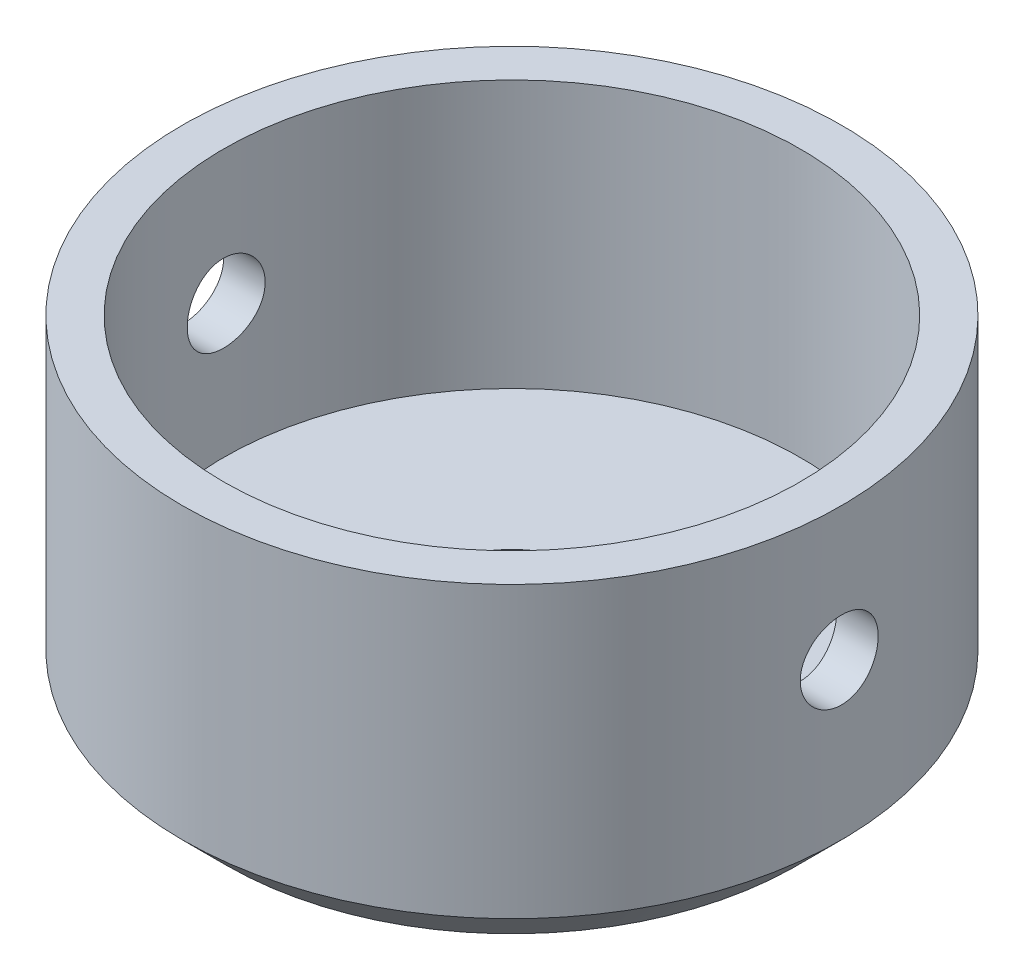
ISO-10303-21;
HEADER;
FILE_DESCRIPTION(('STEP AP214'),'2;1');
FILE_NAME('part.step','',(''),(''),'','','');
FILE_SCHEMA(('AUTOMOTIVE_DESIGN { 1 0 10303 214 1 1 1 1 }'));
ENDSEC;
DATA;
#1=APPLICATION_CONTEXT('core data for automotive mechanical design processes');
#2=APPLICATION_PROTOCOL_DEFINITION('international standard','automotive_design',2000,#1);
#3=PRODUCT_CONTEXT('',#1,'mechanical');
#4=PRODUCT('Part','Part','',(#3));
#5=PRODUCT_RELATED_PRODUCT_CATEGORY('part','',(#4));
#6=PRODUCT_DEFINITION_FORMATION('','',#4);
#7=PRODUCT_DEFINITION_CONTEXT('part definition',#1,'design');
#8=PRODUCT_DEFINITION('design','',#6,#7);
#9=PRODUCT_DEFINITION_SHAPE('','',#8);
#10=(LENGTH_UNIT() NAMED_UNIT(*) SI_UNIT(.MILLI.,.METRE.));
#11=(NAMED_UNIT(*) PLANE_ANGLE_UNIT() SI_UNIT($,.RADIAN.));
#12=(NAMED_UNIT(*) SI_UNIT($,.STERADIAN.) SOLID_ANGLE_UNIT());
#13=UNCERTAINTY_MEASURE_WITH_UNIT(LENGTH_MEASURE(1.E-05),#10,'distance_accuracy_value','');
#14=(GEOMETRIC_REPRESENTATION_CONTEXT(3) GLOBAL_UNCERTAINTY_ASSIGNED_CONTEXT((#13)) GLOBAL_UNIT_ASSIGNED_CONTEXT((#10,
#11,#12)) REPRESENTATION_CONTEXT('',''));
#15=CARTESIAN_POINT('',(0.,0.,0.));
#16=DIRECTION('',(0.,0.,1.));
#17=DIRECTION('',(1.,0.,0.));
#18=AXIS2_PLACEMENT_3D('',#15,#16,#17);
#19=CARTESIAN_POINT('',(0.,15.,0.));
#20=DIRECTION('',(0.,-1.,0.));
#21=DIRECTION('',(0.,0.,-1.));
#22=AXIS2_PLACEMENT_3D('',#19,#20,#21);
#23=CYLINDRICAL_SURFACE('',#22,14.8);
#24=CARTESIAN_POINT('',(0.,2.00000000000001,0.));
#25=DIRECTION('',(0.,1.,0.));
#26=DIRECTION('',(0.,0.,1.));
#27=AXIS2_PLACEMENT_3D('',#24,#25,#26);
#28=CIRCLE('',#27,14.8);
#29=CARTESIAN_POINT('',(0.,2.00000000000001,14.8));
#30=VERTEX_POINT('',#29);
#31=EDGE_CURVE('E43',#30,#30,#28,.T.);
#32=ORIENTED_EDGE('',*,*,#31,.T.);
#33=EDGE_LOOP('',(#32));
#34=FACE_BOUND('',#33,.T.);
#35=CARTESIAN_POINT('',(-14.8,7.25,0.));
#36=CARTESIAN_POINT('',(-14.7999986952949,7.25000418572054,-0.0979316093222418));
#37=CARTESIAN_POINT('',(-14.7990176956042,7.25824822000829,-0.195925453719245));
#38=CARTESIAN_POINT('',(-14.7951986454983,7.29100681402246,-0.389189245630739));
#39=CARTESIAN_POINT('',(-14.7923586248334,7.31553863646052,-0.484456191159775));
#40=CARTESIAN_POINT('',(-14.7851416646429,7.38014246528297,-0.669440089798906));
#41=CARTESIAN_POINT('',(-14.7807657289454,7.42020432348269,-0.759160622941602));
#42=CARTESIAN_POINT('',(-14.770964392339,7.51470951714271,-0.930586942580309));
#43=CARTESIAN_POINT('',(-14.7655391798236,7.56915027157007,-1.01229416387154));
#44=CARTESIAN_POINT('',(-14.7542155662324,7.69115627015748,-1.16579672863309));
#45=CARTESIAN_POINT('',(-14.7483151817859,7.75877839754822,-1.23754671869232));
#46=CARTESIAN_POINT('',(-14.736722343169,7.90510562984001,-1.36870771297023));
#47=CARTESIAN_POINT('',(-14.7310298993101,7.9838112834199,-1.42811810596898));
#48=CARTESIAN_POINT('',(-14.7204777787504,8.15036329456239,-1.53308022872874));
#49=CARTESIAN_POINT('',(-14.7156206513882,8.2382363639365,-1.57858985100355));
#50=CARTESIAN_POINT('',(-14.7073148993142,8.42044472956605,-1.65418969470155));
#51=CARTESIAN_POINT('',(-14.7038662266758,8.51477980580611,-1.68428044080389));
#52=CARTESIAN_POINT('',(-14.6987865654612,8.70676565717123,-1.7280514228951));
#53=CARTESIAN_POINT('',(-14.6971471344236,8.80439882223769,-1.74180790249888));
#54=CARTESIAN_POINT('',(-14.6958456559538,9.00060078070769,-1.75275571048568));
#55=CARTESIAN_POINT('',(-14.6961835370766,9.09916954017754,-1.74994763738464));
#56=CARTESIAN_POINT('',(-14.6987907828828,9.29391502537027,-1.72790870929375));
#57=CARTESIAN_POINT('',(-14.7010502953908,9.39010138154559,-1.70876162248905));
#58=CARTESIAN_POINT('',(-14.7072308447106,9.57788601541969,-1.65471877723623));
#59=CARTESIAN_POINT('',(-14.7111519119379,9.66948420909575,-1.61982273049549));
#60=CARTESIAN_POINT('',(-14.7202249914015,9.84575389790436,-1.53518179237932));
#61=CARTESIAN_POINT('',(-14.7253800333917,9.93040764459749,-1.48540027685127));
#62=CARTESIAN_POINT('',(-14.7363378219633,10.0901910245272,-1.37242774778554));
#63=CARTESIAN_POINT('',(-14.7421405950601,10.1653202676014,-1.30923618520126));
#64=CARTESIAN_POINT('',(-14.7537838567799,10.3044083786599,-1.17077203519594));
#65=CARTESIAN_POINT('',(-14.759624356869,10.3682953465042,-1.09542720248145));
#66=CARTESIAN_POINT('',(-14.7706513632533,10.4825263073996,-0.935044638651567));
#67=CARTESIAN_POINT('',(-14.7758378682977,10.5328702745503,-0.850006888999376));
#68=CARTESIAN_POINT('',(-14.7849752553679,10.6185853474486,-0.67259859602975));
#69=CARTESIAN_POINT('',(-14.7889257863731,10.6539522006534,-0.580225978908039));
#70=CARTESIAN_POINT('',(-14.7951428293942,10.7086533159963,-0.390796234779799));
#71=CARTESIAN_POINT('',(-14.7974094119127,10.7279882493532,-0.293739304074542));
#72=CARTESIAN_POINT('',(-14.7999940458917,10.7499840658658,-0.0983179871165854));
#73=CARTESIAN_POINT('',(-14.8003236773944,10.7527440444127,3.50983472698714E-05));
#74=CARTESIAN_POINT('',(-14.7990284722109,10.7417727571389,0.195802394704574));
#75=CARTESIAN_POINT('',(-14.7974036726785,10.7280418048122,0.293216623410278));
#76=CARTESIAN_POINT('',(-14.7923894316928,10.6845607203131,0.484050437460481));
#77=CARTESIAN_POINT('',(-14.789005168857,10.6548575902003,0.577480879755657));
#78=CARTESIAN_POINT('',(-14.7808511043097,10.5803240141817,0.758033997254352));
#79=CARTESIAN_POINT('',(-14.7760812601063,10.5354931043416,0.845156478907616));
#80=CARTESIAN_POINT('',(-14.765659429173,10.4317350499615,1.01106475940584));
#81=CARTESIAN_POINT('',(-14.7600034548064,10.3727435099915,1.0898100310181));
#82=CARTESIAN_POINT('',(-14.7484552235781,10.2424302066585,1.2363168855083));
#83=CARTESIAN_POINT('',(-14.7425629583619,10.1711080070265,1.30407807959602));
#84=CARTESIAN_POINT('',(-14.7311707638769,10.0177226308287,1.42704269404436));
#85=CARTESIAN_POINT('',(-14.7256729783401,9.93560676152427,1.48218061304494));
#86=CARTESIAN_POINT('',(-14.7157267660477,9.76322192271866,1.57788165782696));
#87=CARTESIAN_POINT('',(-14.7112783201483,9.67295310199884,1.61844504950836));
#88=CARTESIAN_POINT('',(-14.7039487544176,9.48703997359354,1.68373848892646));
#89=CARTESIAN_POINT('',(-14.701063922563,9.39140899711382,1.70850606091224));
#90=CARTESIAN_POINT('',(-14.6971773396096,9.19730934790977,1.74162592356393));
#91=CARTESIAN_POINT('',(-14.6961755108269,9.09884079242071,1.74997889141934));
#92=CARTESIAN_POINT('',(-14.6961704567158,8.90251258555756,1.75002089911669));
#93=CARTESIAN_POINT('',(-14.6971548903337,8.80465294048308,1.74181283602576));
#94=CARTESIAN_POINT('',(-14.7009849729987,8.61171411983693,1.70918304802306));
#95=CARTESIAN_POINT('',(-14.7038306228669,8.51663494549189,1.68476131595855));
#96=CARTESIAN_POINT('',(-14.7110588047192,8.33196589126236,1.62042853748606));
#97=CARTESIAN_POINT('',(-14.7154408996654,8.24237445890775,1.58052189537657));
#98=CARTESIAN_POINT('',(-14.7252489935738,8.07114358870627,1.48636229289766));
#99=CARTESIAN_POINT('',(-14.730675000151,7.98950420887381,1.43210922787426));
#100=CARTESIAN_POINT('',(-14.7419999602969,7.83596833470848,1.3104134581265));
#101=CARTESIAN_POINT('',(-14.74790154169,7.7641328552029,1.2428940149813));
#102=CARTESIAN_POINT('',(-14.7594892185222,7.63277101113398,1.09674068275775));
#103=CARTESIAN_POINT('',(-14.7651752626073,7.57324756517483,1.01810416576435));
#104=CARTESIAN_POINT('',(-14.7757123764209,7.46802929930035,0.851643823384719));
#105=CARTESIAN_POINT('',(-14.7805605262775,7.4223824328977,0.76378951940534));
#106=CARTESIAN_POINT('',(-14.7888455440768,7.34655345281867,0.581656400669133));
#107=CARTESIAN_POINT('',(-14.7922839616138,7.31635434968457,0.487384773591459));
#108=CARTESIAN_POINT('',(-14.7965229183003,7.27959544095307,0.327176244078216));
#109=CARTESIAN_POINT('',(-14.7978205516858,7.268512868443,0.262253946772021));
#110=CARTESIAN_POINT('',(-14.7995595281051,7.25371376524288,0.131563793505313));
#111=CARTESIAN_POINT('',(-14.800000876574,7.24999718779839,0.0657959429144763));
#112=CARTESIAN_POINT('',(-14.8,7.25,0.));
#113=B_SPLINE_CURVE_WITH_KNOTS('',3,(#35,#36,#37,#38,#39,#40,#41,#42,#43,#44,#45,#46,#47,#48,
#49,#50,#51,#52,#53,#54,#55,#56,#57,#58,#59,#60,#61,#62,#63,#64,#65,#66,#67,#68,#69,#70,#71,#72,
#73,#74,#75,#76,#77,#78,#79,#80,#81,#82,#83,#84,#85,#86,#87,#88,#89,#90,#91,#92,#93,#94,#95,#96,
#97,#98,#99,#100,#101,#102,#103,#104,#105,#106,#107,#108,#109,#110,#111,#112),.UNSPECIFIED.,.T.,
.F.,(4,2,2,2,2,2,2,2,2,2,2,2,2,2,2,2,2,2,2,2,2,2,2,2,2,2,2,2,2,2,2,2,2,2,2,2,2,2,4),(0.,
0.29355451699248,0.587420657242348,0.88109509191722,1.1747168473852,1.4696349377939,
1.76456763296224,2.06038505988438,2.35619241995439,2.65061354025754,2.9450240225035,
3.23793410365502,3.53084954688983,3.82449169271809,4.11814586343615,4.41361476488727,
4.70908423140449,5.00463753619881,5.30017846624521,5.59395069558154,5.88771734037342,
6.18062419802684,6.47354003927989,6.767814027092,7.06209842869415,7.35787688854405,
7.65364995189152,7.94871773912328,8.24377335298779,8.53700137164214,8.83022951965575,
9.12337432725884,9.41652127334741,9.71141666826003,10.0063818890898,10.3023551326466,
10.5980021610225,10.7952297872608,10.9924561616254),.UNSPECIFIED.);
#114=CARTESIAN_POINT('',(-14.8,7.25,0.));
#115=VERTEX_POINT('',#114);
#116=EDGE_CURVE('E93',#115,#115,#113,.T.);
#117=ORIENTED_EDGE('',*,*,#116,.T.);
#118=EDGE_LOOP('',(#117));
#119=FACE_BOUND('',#118,.T.);
#120=CARTESIAN_POINT('',(14.6961729712194,9.,-1.75));
#121=CARTESIAN_POINT('',(14.6961743103663,8.9020710888438,-1.74999581189438));
#122=CARTESIAN_POINT('',(14.6971623681676,8.80407993452838,-1.74175221653306));
#123=CARTESIAN_POINT('',(14.7010066241549,8.61082173152154,-1.70899552435169));
#124=CARTESIAN_POINT('',(14.7038648055654,8.51555768693653,-1.6844651553624));
#125=CARTESIAN_POINT('',(14.7111211440009,8.3305799237044,-1.61986557794533));
#126=CARTESIAN_POINT('',(14.7155182882703,8.24086260046452,-1.57980658668179));
#127=CARTESIAN_POINT('',(14.7253558781674,8.0694416640516,-1.48530814543895));
#128=CARTESIAN_POINT('',(14.7307961370005,7.98773662004198,-1.43087126950549));
#129=CARTESIAN_POINT('',(14.7421375845159,7.83423161655709,-1.3088691971131));
#130=CARTESIAN_POINT('',(14.748040729895,7.76247769543858,-1.24124625015531));
#131=CARTESIAN_POINT('',(14.7596251762713,7.63130910846513,-1.09491572550979));
#132=CARTESIAN_POINT('',(14.7653064664856,7.57189504176429,-1.01620760989968));
#133=CARTESIAN_POINT('',(14.7758269343717,7.46692906170207,-0.849653421893256));
#134=CARTESIAN_POINT('',(14.7806635767252,7.42141858544437,-0.761781061187755));
#135=CARTESIAN_POINT('',(14.7889283374593,7.34581696769983,-0.579574235219638));
#136=CARTESIAN_POINT('',(14.7923565028567,7.31572531150452,-0.485239985785905));
#137=CARTESIAN_POINT('',(14.7974042782918,7.2719524508794,-0.293256745917722));
#138=CARTESIAN_POINT('',(14.7990322981267,7.25819491537743,-0.195625383882957));
#139=CARTESIAN_POINT('',(14.800325035821,7.24724437080607,0.000573038355630435));
#140=CARTESIAN_POINT('',(14.7999898232439,7.25005077482443,0.0991400652823601));
#141=CARTESIAN_POINT('',(14.7974006919956,7.27208704467742,0.293892869191417));
#142=CARTESIAN_POINT('',(14.7951563635519,7.29123482304239,0.390088079761203));
#143=CARTESIAN_POINT('',(14.7890120092965,7.34528211445798,0.577890064773179));
#144=CARTESIAN_POINT('',(14.7851119548398,7.38018190002766,0.669496759800874));
#145=CARTESIAN_POINT('',(14.7760779075804,7.46483061168078,0.845776814901968));
#146=CARTESIAN_POINT('',(14.7709409492856,7.51461529489771,0.930432846452378));
#147=CARTESIAN_POINT('',(14.7600083120911,7.62759460199761,1.09021945581677));
#148=CARTESIAN_POINT('',(14.7542126061565,7.69078977633868,1.16534964242275));
#149=CARTESIAN_POINT('',(14.7425697674396,7.8292565077781,1.30443373256174));
#150=CARTESIAN_POINT('',(14.736722536935,7.90459956786682,1.36831646345287));
#151=CARTESIAN_POINT('',(14.7256707644236,8.06497706851397,1.4825397174987));
#152=CARTESIAN_POINT('',(14.7204662240685,8.15001153398102,1.53288020584634));
#153=CARTESIAN_POINT('',(14.711289042986,8.32741889662165,1.61859276836295));
#154=CARTESIAN_POINT('',(14.7073168401981,8.41979438798226,1.65395952289502));
#155=CARTESIAN_POINT('',(14.7010627973536,8.60923038566725,1.70865956196964));
#156=CARTESIAN_POINT('',(14.6987808846681,8.70629069050179,1.72799353541938));
#157=CARTESIAN_POINT('',(14.696178891298,8.90171364112927,1.74998572663878));
#158=CARTESIAN_POINT('',(14.6958470476188,9.00006488399063,1.75274393324415));
#159=CARTESIAN_POINT('',(14.697151677745,9.19582807097366,1.74176975970465));
#160=CARTESIAN_POINT('',(14.6987881141105,9.29324003292654,1.72803769323309));
#161=CARTESIAN_POINT('',(14.7038341972991,9.48406224428385,1.68455681123127));
#162=CARTESIAN_POINT('',(14.7072385197222,9.57748360302788,1.6548560796138));
#163=CARTESIAN_POINT('',(14.7154324815902,9.75801961293132,1.58033033854075));
#164=CARTESIAN_POINT('',(14.720222164831,9.84513406459889,1.53550485093223));
#165=CARTESIAN_POINT('',(14.7306754431276,10.0110367693088,1.43175483594731));
#166=CARTESIAN_POINT('',(14.7363430698316,10.08978363295,1.37276453709485));
#167=CARTESIAN_POINT('',(14.7479008317379,10.2362942766992,1.24245276903581));
#168=CARTESIAN_POINT('',(14.7537909746638,10.3040576751314,1.1711308714838));
#169=CARTESIAN_POINT('',(14.7651660598022,10.4270272024016,1.01774455519128));
#170=CARTESIAN_POINT('',(14.7706487906919,10.482167765949,0.935627385619472));
#171=CARTESIAN_POINT('',(14.780558498295,10.5778734483385,0.763239226826133));
#172=CARTESIAN_POINT('',(14.7849854943512,10.6184388342266,0.672968387033886));
#173=CARTESIAN_POINT('',(14.7922750710261,10.6837335605178,0.48705641221091));
#174=CARTESIAN_POINT('',(14.7951414414672,10.7085012892793,0.391428914390612));
#175=CARTESIAN_POINT('',(14.7990024919812,10.7416226436849,0.197336613860528));
#176=CARTESIAN_POINT('',(14.7999972471394,10.7499769278024,0.098871925133782));
#177=CARTESIAN_POINT('',(14.8000027249411,10.7500228373535,-0.0974584242470147));
#178=CARTESIAN_POINT('',(14.7990255088244,10.7418157576619,-0.195324076427387));
#179=CARTESIAN_POINT('',(14.7952207551241,10.7091858260564,-0.388275160356806));
#180=CARTESIAN_POINT('',(14.792393217925,10.6847629775126,-0.483360592683681));
#181=CARTESIAN_POINT('',(14.7852042354162,10.6204255369087,-0.668042414328276));
#182=CARTESIAN_POINT('',(14.7808432173733,10.5805152597194,-0.75764032445265));
#183=CARTESIAN_POINT('',(14.771071108137,10.4863463768731,-0.928882637741073));
#184=CARTESIAN_POINT('',(14.7656600098164,10.4320876738291,-1.01052698691686));
#185=CARTESIAN_POINT('',(14.7543528596187,10.3103856292926,-1.16406274736386));
#186=CARTESIAN_POINT('',(14.7484541502056,10.2428668436962,-1.2358941640832));
#187=CARTESIAN_POINT('',(14.7368582996818,10.0967165083008,-1.3672481176643));
#188=CARTESIAN_POINT('',(14.7311612068084,10.0180823212888,-1.42676772517716));
#189=CARTESIAN_POINT('',(14.7205925864563,9.85162395017678,-1.53198177377721));
#190=CARTESIAN_POINT('',(14.7157239880798,9.76376886566368,-1.57762759412525));
#191=CARTESIAN_POINT('',(14.7073980280172,9.581634107025,-1.65345440353446));
#192=CARTESIAN_POINT('',(14.7039391156256,9.48736162627157,-1.68365239515339));
#193=CARTESIAN_POINT('',(14.6996735535332,9.32715605842421,-1.72040823197128));
#194=CARTESIAN_POINT('',(14.6983672753572,9.26223779279074,-1.73148942183543));
#195=CARTESIAN_POINT('',(14.6966165371637,9.13155571245699,-1.74628668873088));
#196=CARTESIAN_POINT('',(14.696172071536,9.06579190326402,-1.75000281370881));
#197=CARTESIAN_POINT('',(14.6961729712194,9.,-1.75));
#198=B_SPLINE_CURVE_WITH_KNOTS('',3,(#120,#121,#122,#123,#124,#125,#126,#127,#128,#129,#130,
#131,#132,#133,#134,#135,#136,#137,#138,#139,#140,#141,#142,#143,#144,#145,#146,#147,#148,#149,
#150,#151,#152,#153,#154,#155,#156,#157,#158,#159,#160,#161,#162,#163,#164,#165,#166,#167,#168,
#169,#170,#171,#172,#173,#174,#175,#176,#177,#178,#179,#180,#181,#182,#183,#184,#185,#186,#187,
#188,#189,#190,#191,#192,#193,#194,#195,#196,#197),.UNSPECIFIED.,.T.,.F.,(4,2,2,2,2,2,2,2,2,2,2,
2,2,2,2,2,2,2,2,2,2,2,2,2,2,2,2,2,2,2,2,2,2,2,2,2,2,2,4),(0.,0.293546411580406,
0.587404628263755,0.881069826180267,1.17468248535964,1.46961118411496,1.76455419960715,
2.06036785107959,2.3561716271068,2.65058757075257,2.94499308238193,3.23792835597952,
3.53086869772488,3.82451848590718,4.11818032981375,4.41363840902638,4.70909724763558,
5.00466096439917,5.30021198052626,5.59397836093143,5.88773915348407,6.18062030449016,
6.47351071548705,6.76778833784217,7.06207618416051,7.35785958220686,7.65363756064036,
7.94869403150617,8.24373866507517,8.53698417630692,8.83022962659153,9.12339343589575,
9.41655923503841,9.71144404513224,10.0063989366734,10.3023758869319,10.5980263672562,
10.7952419046805,10.992456158226),.UNSPECIFIED.);
#199=CARTESIAN_POINT('',(14.6961729712194,9.,-1.75));
#200=VERTEX_POINT('',#199);
#201=EDGE_CURVE('E67',#200,#200,#198,.T.);
#202=ORIENTED_EDGE('',*,*,#201,.T.);
#203=EDGE_LOOP('',(#202));
#204=FACE_BOUND('',#203,.T.);
#205=CARTESIAN_POINT('',(0.,15.,0.));
#206=DIRECTION('',(0.,1.,0.));
#207=DIRECTION('',(0.,0.,1.));
#208=AXIS2_PLACEMENT_3D('',#205,#206,#207);
#209=CIRCLE('',#208,14.8);
#210=CARTESIAN_POINT('',(0.,15.,14.8));
#211=VERTEX_POINT('',#210);
#212=EDGE_CURVE('E47',#211,#211,#209,.T.);
#213=ORIENTED_EDGE('',*,*,#212,.F.);
#214=EDGE_LOOP('',(#213));
#215=FACE_BOUND('',#214,.T.);
#216=ADVANCED_FACE('F35',(#34,#119,#204,#215),#23,.T.);
#217=CARTESIAN_POINT('',(0.,15.,0.));
#218=DIRECTION('',(0.,1.,0.));
#219=DIRECTION('',(0.,0.,1.));
#220=AXIS2_PLACEMENT_3D('',#217,#218,#219);
#221=PLANE('',#220);
#222=CARTESIAN_POINT('',(0.,15.,0.));
#223=DIRECTION('',(0.,1.,0.));
#224=DIRECTION('',(0.,0.,1.));
#225=AXIS2_PLACEMENT_3D('',#222,#223,#224);
#226=CIRCLE('',#225,12.95);
#227=CARTESIAN_POINT('',(0.,15.,12.95));
#228=VERTEX_POINT('',#227);
#229=EDGE_CURVE('E112',#228,#228,#226,.T.);
#230=ORIENTED_EDGE('',*,*,#229,.F.);
#231=EDGE_LOOP('',(#230));
#232=FACE_BOUND('',#231,.T.);
#233=ORIENTED_EDGE('',*,*,#212,.T.);
#234=EDGE_LOOP('',(#233));
#235=FACE_BOUND('',#234,.T.);
#236=ADVANCED_FACE('F101',(#232,#235),#221,.T.);
#237=CARTESIAN_POINT('',(0.,0.,0.));
#238=DIRECTION('',(0.,1.,0.));
#239=DIRECTION('',(0.,0.,1.));
#240=AXIS2_PLACEMENT_3D('',#237,#238,#239);
#241=PLANE('',#240);
#242=CARTESIAN_POINT('',(0.,0.,0.));
#243=DIRECTION('',(0.,1.,0.));
#244=DIRECTION('',(0.,0.,1.));
#245=AXIS2_PLACEMENT_3D('',#242,#243,#244);
#246=CIRCLE('',#245,12.8);
#247=CARTESIAN_POINT('',(0.,0.,12.8));
#248=VERTEX_POINT('',#247);
#249=EDGE_CURVE('E11',#248,#248,#246,.F.);
#250=ORIENTED_EDGE('',*,*,#249,.T.);
#251=EDGE_LOOP('',(#250));
#252=FACE_BOUND('',#251,.T.);
#253=CARTESIAN_POINT('',(0.,0.,0.));
#254=DIRECTION('',(0.,-1.,0.));
#255=DIRECTION('',(0.,0.,-1.));
#256=AXIS2_PLACEMENT_3D('',#253,#254,#255);
#257=CIRCLE('',#256,4.1);
#258=CARTESIAN_POINT('',(0.,0.,-4.1));
#259=VERTEX_POINT('',#258);
#260=EDGE_CURVE('E58',#259,#259,#257,.T.);
#261=ORIENTED_EDGE('',*,*,#260,.F.);
#262=EDGE_LOOP('',(#261));
#263=FACE_BOUND('',#262,.T.);
#264=ADVANCED_FACE('F102',(#252,#263),#241,.F.);
#265=CARTESIAN_POINT('',(0.,-36.6281312654632,0.));
#266=DIRECTION('',(0.,1.,0.));
#267=DIRECTION('',(0.,0.,1.));
#268=AXIS2_PLACEMENT_3D('',#265,#266,#267);
#269=CYLINDRICAL_SURFACE('',#268,12.95);
#270=CARTESIAN_POINT('',(-12.8312119458764,9.,-1.75));
#271=CARTESIAN_POINT('',(-12.8312134483912,8.90218444473288,-1.74999588381339));
#272=CARTESIAN_POINT('',(-12.8323425423543,8.8043094214868,-1.74177126125335));
#273=CARTESIAN_POINT('',(-12.8367346970836,8.61128808044379,-1.70909439096969));
#274=CARTESIAN_POINT('',(-12.8399999307124,8.51614464417174,-1.68462561946555));
#275=CARTESIAN_POINT('',(-12.8482879278819,8.33140878173793,-1.62019917213721));
#276=CARTESIAN_POINT('',(-12.8533094385575,8.24181245195471,-1.58025253548325));
#277=CARTESIAN_POINT('',(-12.8645426924495,8.07060992692936,-1.48602888869508));
#278=CARTESIAN_POINT('',(-12.8707542474237,7.98900247108017,-1.43175414448217));
#279=CARTESIAN_POINT('',(-12.883713026973,7.83554702305067,-1.31003640421399));
#280=CARTESIAN_POINT('',(-12.8904631617607,7.76375866489894,-1.24251852575242));
#281=CARTESIAN_POINT('',(-12.9037124407607,7.63249499416511,-1.0963925439809));
#282=CARTESIAN_POINT('',(-12.9102115719796,7.57302031831695,-1.01778386752492));
#283=CARTESIAN_POINT('',(-12.9222566401312,7.46785581686485,-0.851329850572345));
#284=CARTESIAN_POINT('',(-12.9277987819714,7.42222035562753,-0.763449865040301));
#285=CARTESIAN_POINT('',(-12.9372733335847,7.34637816201807,-0.581185572515673));
#286=CARTESIAN_POINT('',(-12.9412058127751,7.31617076429013,-0.486801546217783));
#287=CARTESIAN_POINT('',(-12.9469974432758,7.27222143430775,-0.294820212657438));
#288=CARTESIAN_POINT('',(-12.9488691148779,7.25838003318593,-0.197246060082401));
#289=CARTESIAN_POINT('',(-12.9503710608237,7.24724710770757,-0.00114325821927978));
#290=CARTESIAN_POINT('',(-12.9500014373507,7.24995482885611,0.0973853473496351));
#291=CARTESIAN_POINT('',(-12.9470725205801,7.27176403944716,0.291922715075369));
#292=CARTESIAN_POINT('',(-12.9445275178934,7.29075853950992,0.387943717136279));
#293=CARTESIAN_POINT('',(-12.93754977766,7.34443461140668,0.575422707642157));
#294=CARTESIAN_POINT('',(-12.9331169992051,7.37911652318935,0.66688059715607));
#295=CARTESIAN_POINT('',(-12.9228371433266,7.46329506378354,0.842965589920386));
#296=CARTESIAN_POINT('',(-12.9169857030086,7.51283750775931,0.927570525884864));
#297=CARTESIAN_POINT('',(-12.904522226166,7.62529741297474,1.08730621183245));
#298=CARTESIAN_POINT('',(-12.8979101489183,7.68821559048077,1.16243645410526));
#299=CARTESIAN_POINT('',(-12.8846020649438,7.82623896096211,1.30171947069158));
#300=CARTESIAN_POINT('',(-12.877905809646,7.90143746503724,1.36577978930204));
#301=CARTESIAN_POINT('',(-12.8652359563278,8.06156769572516,1.48038465164651));
#302=CARTESIAN_POINT('',(-12.8592623613183,8.14649946288921,1.53092913906719));
#303=CARTESIAN_POINT('',(-12.8487143420814,8.3237730536726,1.61707559862415));
#304=CARTESIAN_POINT('',(-12.8441406868564,8.41611891490724,1.65266936214402));
#305=CARTESIAN_POINT('',(-12.8369248294883,8.60555289993687,1.70781779930641));
#306=CARTESIAN_POINT('',(-12.8342825179142,8.70264075471565,1.72737338168759));
#307=CARTESIAN_POINT('',(-12.8312488433107,8.897983885151,1.74976623594618));
#308=CARTESIAN_POINT('',(-12.8308399135079,8.99622394101137,1.75273398458348));
#309=CARTESIAN_POINT('',(-12.8322727773247,9.19179989076878,1.74221194328188));
#310=CARTESIAN_POINT('',(-12.8341145146393,9.28913580722331,1.72872256505129));
#311=CARTESIAN_POINT('',(-12.8398251263494,9.47974440378455,1.68577935563895));
#312=CARTESIAN_POINT('',(-12.843685887524,9.57303173956162,1.65638940292576));
#313=CARTESIAN_POINT('',(-12.8529929205365,9.75335498882786,1.58254533658864));
#314=CARTESIAN_POINT('',(-12.8584392568854,9.84039064778015,1.53809061002362));
#315=CARTESIAN_POINT('',(-12.8703455953331,10.0063281596696,1.43506091743846));
#316=CARTESIAN_POINT('',(-12.8768116243014,10.0851767092726,1.3764008102628));
#317=CARTESIAN_POINT('',(-12.8900101744153,10.2319563473489,1.24674508693519));
#318=CARTESIAN_POINT('',(-12.8967427077073,10.2998869374971,1.17574890803924));
#319=CARTESIAN_POINT('',(-12.9097700128164,10.4233646307532,1.02286459040449));
#320=CARTESIAN_POINT('',(-12.9160615493468,10.478825713546,0.940906661395854));
#321=CARTESIAN_POINT('',(-12.927448893864,10.5751932819382,0.768762305174755));
#322=CARTESIAN_POINT('',(-12.9325447293627,10.6161001024289,0.67857606735437));
#323=CARTESIAN_POINT('',(-12.9409522255224,10.6820576624642,0.492814326096274));
#324=CARTESIAN_POINT('',(-12.9442693589719,10.7071570809963,0.397256364907922));
#325=CARTESIAN_POINT('',(-12.9487685254064,10.7409454234005,0.203234367154777));
#326=CARTESIAN_POINT('',(-12.9499506717725,10.7496352187257,0.104770485194545));
#327=CARTESIAN_POINT('',(-12.9500459042474,10.7503394457223,-0.0914306018750904));
#328=CARTESIAN_POINT('',(-12.9489769845811,10.7424861171295,-0.189167349733881));
#329=CARTESIAN_POINT('',(-12.9447261441316,10.7106083961322,-0.381917829975629));
#330=CARTESIAN_POINT('',(-12.9415442266639,10.6865840291012,-0.476931566630949));
#331=CARTESIAN_POINT('',(-12.9334232349102,10.6230898437052,-0.661514241104358));
#332=CARTESIAN_POINT('',(-12.9284850063572,10.5836274584405,-0.751085775292876));
#333=CARTESIAN_POINT('',(-12.9173964996697,10.4903912173892,-0.922356539424334));
#334=CARTESIAN_POINT('',(-12.9112461973845,10.4366170764304,-1.00405561245845));
#335=CARTESIAN_POINT('',(-12.8983603825563,10.3157985661045,-1.15793622068063));
#336=CARTESIAN_POINT('',(-12.8916207615566,10.2486560411504,-1.23004035112345));
#337=CARTESIAN_POINT('',(-12.8783478909409,10.1032122256547,-1.36200819310089));
#338=CARTESIAN_POINT('',(-12.8718146903691,10.024908307227,-1.42186901391367));
#339=CARTESIAN_POINT('',(-12.8596628617882,9.85895397561308,-1.52788743762798));
#340=CARTESIAN_POINT('',(-12.8540484981923,9.77126294205607,-1.57398192188258));
#341=CARTESIAN_POINT('',(-12.8444199348882,9.5893544874942,-1.65072275351113));
#342=CARTESIAN_POINT('',(-12.8404040262523,9.49514416356748,-1.68138560835713));
#343=CARTESIAN_POINT('',(-12.8353841665366,9.33372496628601,-1.71919739332323));
#344=CARTESIAN_POINT('',(-12.833827566345,9.26752667047086,-1.73073135862233));
#345=CARTESIAN_POINT('',(-12.8317409453118,9.1342282466129,-1.74613403805341));
#346=CARTESIAN_POINT('',(-12.8312109147417,9.06712812712243,-1.75000282482574));
#347=CARTESIAN_POINT('',(-12.8312119458764,9.,-1.75));
#348=B_SPLINE_CURVE_WITH_KNOTS('',3,(#270,#271,#272,#273,#274,#275,#276,#277,#278,#279,#280,
#281,#282,#283,#284,#285,#286,#287,#288,#289,#290,#291,#292,#293,#294,#295,#296,#297,#298,#299,
#300,#301,#302,#303,#304,#305,#306,#307,#308,#309,#310,#311,#312,#313,#314,#315,#316,#317,#318,
#319,#320,#321,#322,#323,#324,#325,#326,#327,#328,#329,#330,#331,#332,#333,#334,#335,#336,#337,
#338,#339,#340,#341,#342,#343,#344,#345,#346,#347),.UNSPECIFIED.,.T.,.F.,(4,2,2,2,2,2,2,2,2,2,2,
2,2,2,2,2,2,2,2,2,2,2,2,2,2,2,2,2,2,2,2,2,2,2,2,2,2,2,4),(0.,0.293201387530419,
0.586701481630966,0.879992628884298,1.17323742130983,1.46819080712679,1.76315944101878,
2.05927221762721,2.3553722228991,2.64966319365279,2.94394074741782,3.23629984610481,
3.52866528056296,3.82194151039476,4.11523344903507,4.41086757188697,4.70650292647072,
5.00230038659121,5.29808108538685,5.59153191969396,5.88497541288553,6.17724869554428,
6.46953387136642,6.76361623649569,7.05771202052837,7.35377828055438,7.64983772770214,
7.94498094174371,8.24010848140118,8.53288583427,8.8256627277507,9.11829882810464,
9.41094075988674,9.70581635606875,10.0007614940533,10.2970388962031,10.5929986881987,
10.7942166487149,10.9954327023463),.UNSPECIFIED.);
#349=CARTESIAN_POINT('',(-12.8312119458764,9.,-1.75));
#350=VERTEX_POINT('',#349);
#351=EDGE_CURVE('E59',#350,#350,#348,.T.);
#352=ORIENTED_EDGE('',*,*,#351,.T.);
#353=EDGE_LOOP('',(#352));
#354=FACE_BOUND('',#353,.T.);
#355=CARTESIAN_POINT('',(12.8312119458764,9.,-1.75));
#356=CARTESIAN_POINT('',(12.8312134483912,9.09781555526712,-1.74999588381339));
#357=CARTESIAN_POINT('',(12.8323425423543,9.1956905785132,-1.74177126125335));
#358=CARTESIAN_POINT('',(12.8367346970836,9.38871191955621,-1.70909439096969));
#359=CARTESIAN_POINT('',(12.8399999307124,9.48385535582826,-1.68462561946555));
#360=CARTESIAN_POINT('',(12.8482879278819,9.66859121826207,-1.62019917213721));
#361=CARTESIAN_POINT('',(12.8533094385575,9.75818754804529,-1.58025253548325));
#362=CARTESIAN_POINT('',(12.8645426924495,9.92939007307064,-1.48602888869508));
#363=CARTESIAN_POINT('',(12.8707542474237,10.0109975289198,-1.43175414448217));
#364=CARTESIAN_POINT('',(12.883713026973,10.1644529769493,-1.31003640421399));
#365=CARTESIAN_POINT('',(12.8904631617607,10.2362413351011,-1.24251852575242));
#366=CARTESIAN_POINT('',(12.9037124407607,10.3675050058349,-1.09639254398089));
#367=CARTESIAN_POINT('',(12.9102115719796,10.4269796816831,-1.01778386752492));
#368=CARTESIAN_POINT('',(12.9222566401312,10.5321441831352,-0.851329850572345));
#369=CARTESIAN_POINT('',(12.9277987819714,10.5777796443725,-0.7634498650403));
#370=CARTESIAN_POINT('',(12.9372733335847,10.6536218379819,-0.581185572515672));
#371=CARTESIAN_POINT('',(12.9412058127751,10.6838292357099,-0.486801546217782));
#372=CARTESIAN_POINT('',(12.9469974432758,10.7277785656923,-0.294820212657437));
#373=CARTESIAN_POINT('',(12.9488691148779,10.7416199668141,-0.197246060082401));
#374=CARTESIAN_POINT('',(12.9503710608237,10.7527528922924,-0.00114325821927933));
#375=CARTESIAN_POINT('',(12.9500014373507,10.7500451711439,0.0973853473496354));
#376=CARTESIAN_POINT('',(12.9470725205801,10.7282359605528,0.291922715075369));
#377=CARTESIAN_POINT('',(12.9445275178934,10.7092414604901,0.387943717136279));
#378=CARTESIAN_POINT('',(12.93754977766,10.6555653885933,0.575422707642157));
#379=CARTESIAN_POINT('',(12.9331169992051,10.6208834768107,0.66688059715607));
#380=CARTESIAN_POINT('',(12.9228371433266,10.5367049362165,0.842965589920386));
#381=CARTESIAN_POINT('',(12.9169857030086,10.4871624922407,0.927570525884865));
#382=CARTESIAN_POINT('',(12.904522226166,10.3747025870253,1.08730621183245));
#383=CARTESIAN_POINT('',(12.8979101489183,10.3117844095192,1.16243645410526));
#384=CARTESIAN_POINT('',(12.8846020649438,10.1737610390379,1.30171947069158));
#385=CARTESIAN_POINT('',(12.877905809646,10.0985625349628,1.36577978930204));
#386=CARTESIAN_POINT('',(12.8652359563278,9.93843230427484,1.48038465164651));
#387=CARTESIAN_POINT('',(12.8592623613183,9.8535005371108,1.53092913906719));
#388=CARTESIAN_POINT('',(12.8487143420814,9.6762269463274,1.61707559862415));
#389=CARTESIAN_POINT('',(12.8441406868564,9.58388108509276,1.65266936214402));
#390=CARTESIAN_POINT('',(12.8369248294883,9.39444710006313,1.70781779930641));
#391=CARTESIAN_POINT('',(12.8342825179142,9.29735924528436,1.72737338168759));
#392=CARTESIAN_POINT('',(12.8312488433107,9.102016114849,1.74976623594619));
#393=CARTESIAN_POINT('',(12.8308399135079,9.00377605898863,1.75273398458348));
#394=CARTESIAN_POINT('',(12.8322727773247,8.80820010923122,1.74221194328188));
#395=CARTESIAN_POINT('',(12.8341145146393,8.71086419277669,1.72872256505129));
#396=CARTESIAN_POINT('',(12.8398251263494,8.52025559621545,1.68577935563895));
#397=CARTESIAN_POINT('',(12.843685887524,8.42696826043839,1.65638940292576));
#398=CARTESIAN_POINT('',(12.8529929205365,8.24664501117214,1.58254533658864));
#399=CARTESIAN_POINT('',(12.8584392568854,8.15960935221985,1.53809061002362));
#400=CARTESIAN_POINT('',(12.8703455953331,7.99367184033043,1.43506091743846));
#401=CARTESIAN_POINT('',(12.8768116243014,7.91482329072741,1.3764008102628));
#402=CARTESIAN_POINT('',(12.8900101744153,7.76804365265107,1.24674508693519));
#403=CARTESIAN_POINT('',(12.8967427077073,7.70011306250289,1.17574890803925));
#404=CARTESIAN_POINT('',(12.9097700128164,7.57663536924679,1.02286459040449));
#405=CARTESIAN_POINT('',(12.9160615493468,7.52117428645397,0.940906661395855));
#406=CARTESIAN_POINT('',(12.927448893864,7.42480671806177,0.768762305174755));
#407=CARTESIAN_POINT('',(12.9325447293627,7.38389989757114,0.67857606735437));
#408=CARTESIAN_POINT('',(12.9409522255224,7.31794233753579,0.492814326096275));
#409=CARTESIAN_POINT('',(12.9442693589719,7.29284291900366,0.397256364907923));
#410=CARTESIAN_POINT('',(12.9487685254064,7.25905457659952,0.203234367154778));
#411=CARTESIAN_POINT('',(12.9499506717725,7.2503647812743,0.104770485194546));
#412=CARTESIAN_POINT('',(12.9500459042474,7.24966055427772,-0.0914306018750887));
#413=CARTESIAN_POINT('',(12.9489769845811,7.2575138828705,-0.189167349733879));
#414=CARTESIAN_POINT('',(12.9447261441316,7.28939160386782,-0.381917829975628));
#415=CARTESIAN_POINT('',(12.9415442266639,7.31341597089881,-0.476931566630948));
#416=CARTESIAN_POINT('',(12.9334232349102,7.37691015629476,-0.661514241104357));
#417=CARTESIAN_POINT('',(12.9284850063572,7.41637254155954,-0.751085775292875));
#418=CARTESIAN_POINT('',(12.9173964996697,7.5096087826108,-0.922356539424334));
#419=CARTESIAN_POINT('',(12.9112461973845,7.56338292356964,-1.00405561245845));
#420=CARTESIAN_POINT('',(12.8983603825563,7.68420143389547,-1.15793622068063));
#421=CARTESIAN_POINT('',(12.8916207615566,7.75134395884963,-1.23004035112345));
#422=CARTESIAN_POINT('',(12.8783478909409,7.8967877743453,-1.36200819310089));
#423=CARTESIAN_POINT('',(12.8718146903691,7.975091692773,-1.42186901391367));
#424=CARTESIAN_POINT('',(12.8596628617882,8.14104602438692,-1.52788743762798));
#425=CARTESIAN_POINT('',(12.8540484981923,8.22873705794393,-1.57398192188258));
#426=CARTESIAN_POINT('',(12.8444199348882,8.4106455125058,-1.65072275351113));
#427=CARTESIAN_POINT('',(12.8404040262523,8.50485583643252,-1.68138560835713));
#428=CARTESIAN_POINT('',(12.8353841665366,8.666275033714,-1.71919739332323));
#429=CARTESIAN_POINT('',(12.833827566345,8.73247332952914,-1.73073135862233));
#430=CARTESIAN_POINT('',(12.8317409453118,8.86577175338711,-1.74613403805341));
#431=CARTESIAN_POINT('',(12.8312109147417,8.93287187287757,-1.75000282482574));
#432=CARTESIAN_POINT('',(12.8312119458764,9.,-1.75));
#433=B_SPLINE_CURVE_WITH_KNOTS('',3,(#355,#356,#357,#358,#359,#360,#361,#362,#363,#364,#365,
#366,#367,#368,#369,#370,#371,#372,#373,#374,#375,#376,#377,#378,#379,#380,#381,#382,#383,#384,
#385,#386,#387,#388,#389,#390,#391,#392,#393,#394,#395,#396,#397,#398,#399,#400,#401,#402,#403,
#404,#405,#406,#407,#408,#409,#410,#411,#412,#413,#414,#415,#416,#417,#418,#419,#420,#421,#422,
#423,#424,#425,#426,#427,#428,#429,#430,#431,#432),.UNSPECIFIED.,.T.,.F.,(4,2,2,2,2,2,2,2,2,2,2,
2,2,2,2,2,2,2,2,2,2,2,2,2,2,2,2,2,2,2,2,2,2,2,2,2,2,2,4),(0.,0.293201387530419,
0.586701481630966,0.879992628884298,1.17323742130983,1.4681908071268,1.76315944101878,
2.05927221762721,2.3553722228991,2.64966319365279,2.94394074741782,3.23629984610481,
3.52866528056296,3.82194151039476,4.11523344903507,4.41086757188697,4.70650292647072,
5.00230038659121,5.29808108538685,5.59153191969396,5.88497541288553,6.17724869554428,
6.46953387136642,6.76361623649569,7.05771202052837,7.35377828055438,7.64983772770214,
7.94498094174371,8.24010848140118,8.53288583427,8.8256627277507,9.11829882810464,
9.41094075988674,9.70581635606876,10.0007614940533,10.2970388962031,10.5929986881987,
10.7942166487149,10.9954327023463),.UNSPECIFIED.);
#434=CARTESIAN_POINT('',(12.8312119458764,9.,-1.75));
#435=VERTEX_POINT('',#434);
#436=EDGE_CURVE('E57',#435,#435,#433,.T.);
#437=ORIENTED_EDGE('',*,*,#436,.T.);
#438=EDGE_LOOP('',(#437));
#439=FACE_BOUND('',#438,.T.);
#440=CARTESIAN_POINT('',(0.,3.,0.));
#441=DIRECTION('',(0.,1.,0.));
#442=DIRECTION('',(0.,0.,1.));
#443=AXIS2_PLACEMENT_3D('',#440,#441,#442);
#444=CIRCLE('',#443,12.95);
#445=CARTESIAN_POINT('',(0.,3.,12.95));
#446=VERTEX_POINT('',#445);
#447=EDGE_CURVE('E51',#446,#446,#444,.F.);
#448=ORIENTED_EDGE('',*,*,#447,.T.);
#449=EDGE_LOOP('',(#448));
#450=FACE_BOUND('',#449,.T.);
#451=ORIENTED_EDGE('',*,*,#229,.T.);
#452=EDGE_LOOP('',(#451));
#453=FACE_BOUND('',#452,.T.);
#454=ADVANCED_FACE('F71',(#354,#439,#450,#453),#269,.F.);
#455=CARTESIAN_POINT('',(0.,3.,0.));
#456=DIRECTION('',(0.,1.,0.));
#457=DIRECTION('',(0.,0.,1.));
#458=AXIS2_PLACEMENT_3D('',#455,#456,#457);
#459=PLANE('',#458);
#460=CARTESIAN_POINT('',(0.,3.,0.));
#461=DIRECTION('',(0.,1.,0.));
#462=DIRECTION('',(0.,0.,1.));
#463=AXIS2_PLACEMENT_3D('',#460,#461,#462);
#464=CIRCLE('',#463,4.1);
#465=CARTESIAN_POINT('',(0.,3.,4.1));
#466=VERTEX_POINT('',#465);
#467=EDGE_CURVE('E54',#466,#466,#464,.T.);
#468=ORIENTED_EDGE('',*,*,#467,.F.);
#469=EDGE_LOOP('',(#468));
#470=FACE_BOUND('',#469,.T.);
#471=ORIENTED_EDGE('',*,*,#447,.F.);
#472=EDGE_LOOP('',(#471));
#473=FACE_BOUND('',#472,.T.);
#474=ADVANCED_FACE('F82',(#470,#473),#459,.T.);
#475=CARTESIAN_POINT('',(-14.8,9.,0.));
#476=DIRECTION('',(1.,0.,0.));
#477=DIRECTION('',(0.,0.,-1.));
#478=AXIS2_PLACEMENT_3D('',#475,#476,#477);
#479=CYLINDRICAL_SURFACE('',#478,1.75);
#480=ORIENTED_EDGE('',*,*,#436,.F.);
#481=EDGE_LOOP('',(#480));
#482=FACE_BOUND('',#481,.T.);
#483=ORIENTED_EDGE('',*,*,#201,.F.);
#484=EDGE_LOOP('',(#483));
#485=FACE_BOUND('',#484,.T.);
#486=ADVANCED_FACE('F80',(#482,#485),#479,.F.);
#487=ORIENTED_EDGE('',*,*,#351,.F.);
#488=EDGE_LOOP('',(#487));
#489=FACE_BOUND('',#488,.T.);
#490=ORIENTED_EDGE('',*,*,#116,.F.);
#491=EDGE_LOOP('',(#490));
#492=FACE_BOUND('',#491,.T.);
#493=ADVANCED_FACE('F75',(#489,#492),#479,.F.);
#494=CARTESIAN_POINT('',(0.,15.,0.));
#495=DIRECTION('',(0.,-1.,0.));
#496=DIRECTION('',(0.,0.,-1.));
#497=AXIS2_PLACEMENT_3D('',#494,#495,#496);
#498=CYLINDRICAL_SURFACE('',#497,4.1);
#499=ORIENTED_EDGE('',*,*,#467,.T.);
#500=EDGE_LOOP('',(#499));
#501=FACE_BOUND('',#500,.T.);
#502=ORIENTED_EDGE('',*,*,#260,.T.);
#503=EDGE_LOOP('',(#502));
#504=FACE_BOUND('',#503,.T.);
#505=ADVANCED_FACE('F79',(#501,#504),#498,.F.);
#506=CARTESIAN_POINT('',(0.,2.00000000000001,0.));
#507=DIRECTION('',(0.,1.,0.));
#508=DIRECTION('',(0.,0.,1.));
#509=AXIS2_PLACEMENT_3D('',#506,#507,#508);
#510=CONICAL_SURFACE('',#509,14.8,0.78539816339745);
#511=ORIENTED_EDGE('',*,*,#249,.F.);
#512=EDGE_LOOP('',(#511));
#513=FACE_BOUND('',#512,.T.);
#514=ORIENTED_EDGE('',*,*,#31,.F.);
#515=EDGE_LOOP('',(#514));
#516=FACE_BOUND('',#515,.T.);
#517=ADVANCED_FACE('F38',(#513,#516),#510,.T.);
#518=CLOSED_SHELL('',(#216,#236,#264,#454,#474,#486,#493,#505,#517));
#519=MANIFOLD_SOLID_BREP('B2',#518);
#520=ADVANCED_BREP_SHAPE_REPRESENTATION('',(#18,#519),#14);
#521=SHAPE_DEFINITION_REPRESENTATION(#9,#520);
ENDSEC;
END-ISO-10303-21;
